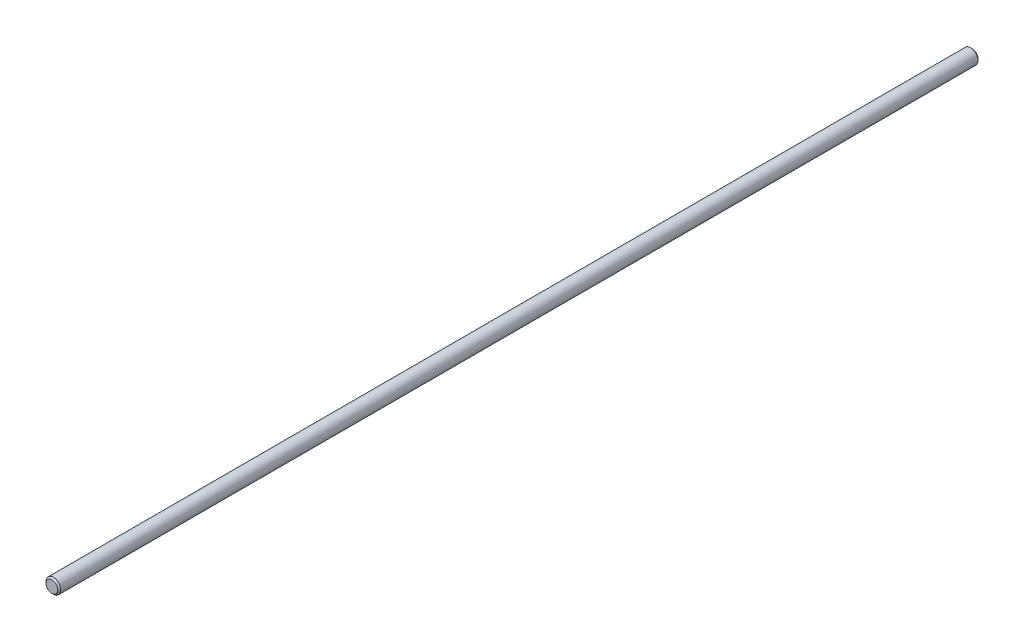
ISO-10303-21;
HEADER;
FILE_DESCRIPTION(('STEP AP214'),'2;1');
FILE_NAME('part.step','',(''),(''),'','','');
FILE_SCHEMA(('AUTOMOTIVE_DESIGN { 1 0 10303 214 1 1 1 1 }'));
ENDSEC;
DATA;
#1=APPLICATION_CONTEXT('core data for automotive mechanical design processes');
#2=APPLICATION_PROTOCOL_DEFINITION('international standard','automotive_design',2000,#1);
#3=PRODUCT_CONTEXT('',#1,'mechanical');
#4=PRODUCT('Part','Part','',(#3));
#5=PRODUCT_RELATED_PRODUCT_CATEGORY('part','',(#4));
#6=PRODUCT_DEFINITION_FORMATION('','',#4);
#7=PRODUCT_DEFINITION_CONTEXT('part definition',#1,'design');
#8=PRODUCT_DEFINITION('design','',#6,#7);
#9=PRODUCT_DEFINITION_SHAPE('','',#8);
#10=(LENGTH_UNIT() NAMED_UNIT(*) SI_UNIT(.MILLI.,.METRE.));
#11=(NAMED_UNIT(*) PLANE_ANGLE_UNIT() SI_UNIT($,.RADIAN.));
#12=(NAMED_UNIT(*) SI_UNIT($,.STERADIAN.) SOLID_ANGLE_UNIT());
#13=UNCERTAINTY_MEASURE_WITH_UNIT(LENGTH_MEASURE(1.E-05),#10,'distance_accuracy_value','');
#14=(GEOMETRIC_REPRESENTATION_CONTEXT(3) GLOBAL_UNCERTAINTY_ASSIGNED_CONTEXT((#13)) GLOBAL_UNIT_ASSIGNED_CONTEXT((#10,
#11,#12)) REPRESENTATION_CONTEXT('',''));
#15=CARTESIAN_POINT('',(0.,0.,0.));
#16=DIRECTION('',(0.,0.,1.));
#17=DIRECTION('',(1.,0.,0.));
#18=AXIS2_PLACEMENT_3D('',#15,#16,#17);
#19=CARTESIAN_POINT('',(0.,0.,500.));
#20=DIRECTION('',(0.,0.,-1.));
#21=DIRECTION('',(-1.,0.,0.));
#22=AXIS2_PLACEMENT_3D('',#19,#20,#21);
#23=CYLINDRICAL_SURFACE('',#22,8.);
#24=CARTESIAN_POINT('',(0.,0.,-498.4));
#25=DIRECTION('',(0.,0.,1.));
#26=DIRECTION('',(1.,0.,0.));
#27=AXIS2_PLACEMENT_3D('',#24,#25,#26);
#28=CIRCLE('',#27,8.);
#29=CARTESIAN_POINT('',(8.,0.,-498.4));
#30=VERTEX_POINT('',#29);
#31=EDGE_CURVE('E40',#30,#30,#28,.T.);
#32=ORIENTED_EDGE('',*,*,#31,.T.);
#33=EDGE_LOOP('',(#32));
#34=FACE_BOUND('',#33,.T.);
#35=CARTESIAN_POINT('',(0.,0.,498.4));
#36=DIRECTION('',(0.,0.,1.));
#37=DIRECTION('',(1.,0.,0.));
#38=AXIS2_PLACEMENT_3D('',#35,#36,#37);
#39=CIRCLE('',#38,8.);
#40=CARTESIAN_POINT('',(8.,0.,498.4));
#41=VERTEX_POINT('',#40);
#42=EDGE_CURVE('E44',#41,#41,#39,.F.);
#43=ORIENTED_EDGE('',*,*,#42,.T.);
#44=EDGE_LOOP('',(#43));
#45=FACE_BOUND('',#44,.T.);
#46=ADVANCED_FACE('F29',(#34,#45),#23,.T.);
#47=CARTESIAN_POINT('',(0.,0.,500.));
#48=DIRECTION('',(0.,0.,1.));
#49=DIRECTION('',(1.,0.,0.));
#50=AXIS2_PLACEMENT_3D('',#47,#48,#49);
#51=PLANE('',#50);
#52=CARTESIAN_POINT('',(0.,0.,500.));
#53=DIRECTION('',(0.,0.,1.));
#54=DIRECTION('',(1.,0.,0.));
#55=AXIS2_PLACEMENT_3D('',#52,#53,#54);
#56=CIRCLE('',#55,6.40000000000007);
#57=CARTESIAN_POINT('',(6.40000000000007,0.,500.));
#58=VERTEX_POINT('',#57);
#59=EDGE_CURVE('E10',#58,#58,#56,.T.);
#60=ORIENTED_EDGE('',*,*,#59,.T.);
#61=EDGE_LOOP('',(#60));
#62=FACE_BOUND('',#61,.T.);
#63=ADVANCED_FACE('F60',(#62),#51,.T.);
#64=CARTESIAN_POINT('',(0.,0.,-500.));
#65=DIRECTION('',(0.,0.,1.));
#66=DIRECTION('',(1.,0.,0.));
#67=AXIS2_PLACEMENT_3D('',#64,#65,#66);
#68=PLANE('',#67);
#69=CARTESIAN_POINT('',(0.,0.,-500.));
#70=DIRECTION('',(0.,0.,1.));
#71=DIRECTION('',(1.,0.,0.));
#72=AXIS2_PLACEMENT_3D('',#69,#70,#71);
#73=CIRCLE('',#72,6.39999999999996);
#74=CARTESIAN_POINT('',(6.39999999999996,0.,-500.));
#75=VERTEX_POINT('',#74);
#76=EDGE_CURVE('E36',#75,#75,#73,.F.);
#77=ORIENTED_EDGE('',*,*,#76,.T.);
#78=EDGE_LOOP('',(#77));
#79=FACE_BOUND('',#78,.T.);
#80=ADVANCED_FACE('F57',(#79),#68,.F.);
#81=CARTESIAN_POINT('',(0.,0.,-498.4));
#82=DIRECTION('',(0.,0.,1.));
#83=DIRECTION('',(1.,0.,0.));
#84=AXIS2_PLACEMENT_3D('',#81,#82,#83);
#85=CONICAL_SURFACE('',#84,8.,0.785398163397446);
#86=ORIENTED_EDGE('',*,*,#76,.F.);
#87=EDGE_LOOP('',(#86));
#88=FACE_BOUND('',#87,.T.);
#89=ORIENTED_EDGE('',*,*,#31,.F.);
#90=EDGE_LOOP('',(#89));
#91=FACE_BOUND('',#90,.T.);
#92=ADVANCED_FACE('F53',(#88,#91),#85,.T.);
#93=CARTESIAN_POINT('',(0.,0.,500.));
#94=DIRECTION('',(0.,0.,-1.));
#95=DIRECTION('',(-1.,0.,0.));
#96=AXIS2_PLACEMENT_3D('',#93,#94,#95);
#97=CONICAL_SURFACE('',#96,6.40000000000007,0.785398163397481);
#98=ORIENTED_EDGE('',*,*,#42,.F.);
#99=EDGE_LOOP('',(#98));
#100=FACE_BOUND('',#99,.T.);
#101=ORIENTED_EDGE('',*,*,#59,.F.);
#102=EDGE_LOOP('',(#101));
#103=FACE_BOUND('',#102,.T.);
#104=ADVANCED_FACE('F31',(#100,#103),#97,.T.);
#105=CLOSED_SHELL('',(#46,#63,#80,#92,#104));
#106=MANIFOLD_SOLID_BREP('B2',#105);
#107=ADVANCED_BREP_SHAPE_REPRESENTATION('',(#18,#106),#14);
#108=SHAPE_DEFINITION_REPRESENTATION(#9,#107);
ENDSEC;
END-ISO-10303-21;
